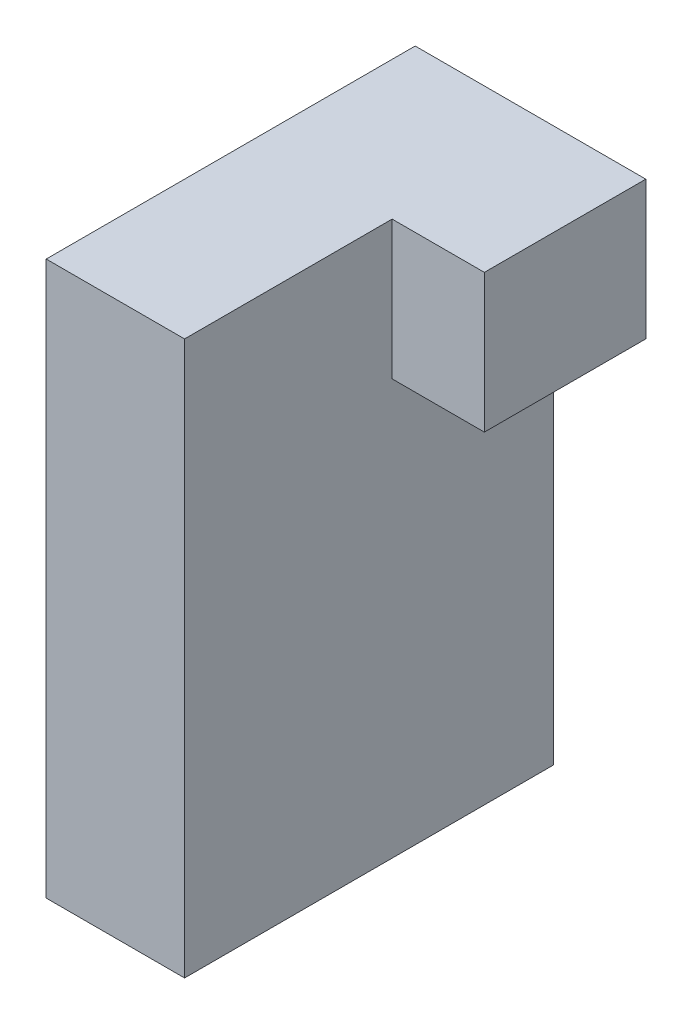
ISO-10303-21;
HEADER;
FILE_DESCRIPTION(('STEP AP214'),'2;1');
FILE_NAME('part.step','',(''),(''),'','','');
FILE_SCHEMA(('AUTOMOTIVE_DESIGN { 1 0 10303 214 1 1 1 1 }'));
ENDSEC;
DATA;
#1=APPLICATION_CONTEXT('core data for automotive mechanical design processes');
#2=APPLICATION_PROTOCOL_DEFINITION('international standard','automotive_design',2000,#1);
#3=PRODUCT_CONTEXT('',#1,'mechanical');
#4=PRODUCT('Part','Part','',(#3));
#5=PRODUCT_RELATED_PRODUCT_CATEGORY('part','',(#4));
#6=PRODUCT_DEFINITION_FORMATION('','',#4);
#7=PRODUCT_DEFINITION_CONTEXT('part definition',#1,'design');
#8=PRODUCT_DEFINITION('design','',#6,#7);
#9=PRODUCT_DEFINITION_SHAPE('','',#8);
#10=(LENGTH_UNIT() NAMED_UNIT(*) SI_UNIT(.MILLI.,.METRE.));
#11=(NAMED_UNIT(*) PLANE_ANGLE_UNIT() SI_UNIT($,.RADIAN.));
#12=(NAMED_UNIT(*) SI_UNIT($,.STERADIAN.) SOLID_ANGLE_UNIT());
#13=UNCERTAINTY_MEASURE_WITH_UNIT(LENGTH_MEASURE(1.E-05),#10,'distance_accuracy_value','');
#14=(GEOMETRIC_REPRESENTATION_CONTEXT(3) GLOBAL_UNCERTAINTY_ASSIGNED_CONTEXT((#13)) GLOBAL_UNIT_ASSIGNED_CONTEXT((#10,
#11,#12)) REPRESENTATION_CONTEXT('',''));
#15=CARTESIAN_POINT('',(0.,0.,0.));
#16=DIRECTION('',(0.,0.,1.));
#17=DIRECTION('',(1.,0.,0.));
#18=AXIS2_PLACEMENT_3D('',#15,#16,#17);
#19=CARTESIAN_POINT('',(9.525,38.1,25.4));
#20=DIRECTION('',(0.,0.,-1.));
#21=DIRECTION('',(0.,1.,0.));
#22=AXIS2_PLACEMENT_3D('',#19,#20,#21);
#23=PLANE('',#22);
#24=DIRECTION('',(0.,-1.,0.));
#25=VECTOR('',#24,1.);
#26=CARTESIAN_POINT('',(-9.525,38.1,25.4));
#27=LINE('',#26,#25);
#28=CARTESIAN_POINT('',(-9.525,38.1,25.4));
#29=VERTEX_POINT('',#28);
#30=CARTESIAN_POINT('',(-9.525,-38.1,25.4));
#31=VERTEX_POINT('',#30);
#32=EDGE_CURVE('E135',#29,#31,#27,.T.);
#33=ORIENTED_EDGE('',*,*,#32,.T.);
#34=DIRECTION('',(-1.,0.,0.));
#35=VECTOR('',#34,1.);
#36=CARTESIAN_POINT('',(9.525,-38.1,25.4));
#37=LINE('',#36,#35);
#38=CARTESIAN_POINT('',(9.525,-38.1,25.4));
#39=VERTEX_POINT('',#38);
#40=EDGE_CURVE('E11',#39,#31,#37,.T.);
#41=ORIENTED_EDGE('',*,*,#40,.F.);
#42=DIRECTION('',(0.,-1.,0.));
#43=VECTOR('',#42,1.);
#44=CARTESIAN_POINT('',(9.525,38.1,25.4));
#45=LINE('',#44,#43);
#46=CARTESIAN_POINT('',(9.525,38.1,25.4));
#47=VERTEX_POINT('',#46);
#48=EDGE_CURVE('E156',#47,#39,#45,.T.);
#49=ORIENTED_EDGE('',*,*,#48,.F.);
#50=DIRECTION('',(-1.,0.,0.));
#51=VECTOR('',#50,1.);
#52=CARTESIAN_POINT('',(9.525,38.1,25.4));
#53=LINE('',#52,#51);
#54=EDGE_CURVE('E103',#47,#29,#53,.T.);
#55=ORIENTED_EDGE('',*,*,#54,.T.);
#56=EDGE_LOOP('',(#33,#41,#49,#55));
#57=FACE_BOUND('',#56,.T.);
#58=ADVANCED_FACE('F33',(#57),#23,.F.);
#59=CARTESIAN_POINT('',(9.525,-38.1,25.4));
#60=DIRECTION('',(0.,1.,0.));
#61=DIRECTION('',(0.,0.,1.));
#62=AXIS2_PLACEMENT_3D('',#59,#60,#61);
#63=PLANE('',#62);
#64=DIRECTION('',(0.,0.,-1.));
#65=VECTOR('',#64,1.);
#66=CARTESIAN_POINT('',(-9.525,-38.1,25.4));
#67=LINE('',#66,#65);
#68=CARTESIAN_POINT('',(-9.525,-38.1,-25.4));
#69=VERTEX_POINT('',#68);
#70=EDGE_CURVE('E138',#31,#69,#67,.T.);
#71=ORIENTED_EDGE('',*,*,#70,.T.);
#72=DIRECTION('',(-1.,0.,0.));
#73=VECTOR('',#72,1.);
#74=CARTESIAN_POINT('',(9.525,-38.1,-25.4));
#75=LINE('',#74,#73);
#76=CARTESIAN_POINT('',(9.525,-38.1,-25.4));
#77=VERTEX_POINT('',#76);
#78=EDGE_CURVE('E41',#77,#69,#75,.T.);
#79=ORIENTED_EDGE('',*,*,#78,.F.);
#80=DIRECTION('',(0.,0.,-1.));
#81=VECTOR('',#80,1.);
#82=CARTESIAN_POINT('',(9.525,-38.1,25.4));
#83=LINE('',#82,#81);
#84=EDGE_CURVE('E169',#39,#77,#83,.T.);
#85=ORIENTED_EDGE('',*,*,#84,.F.);
#86=ORIENTED_EDGE('',*,*,#40,.T.);
#87=EDGE_LOOP('',(#71,#79,#85,#86));
#88=FACE_BOUND('',#87,.T.);
#89=ADVANCED_FACE('F171',(#88),#63,.F.);
#90=CARTESIAN_POINT('',(9.525,38.1,-25.4));
#91=DIRECTION('',(0.,0.,1.));
#92=DIRECTION('',(0.,-1.,0.));
#93=AXIS2_PLACEMENT_3D('',#90,#91,#92);
#94=PLANE('',#93);
#95=DIRECTION('',(0.,1.,0.));
#96=VECTOR('',#95,1.);
#97=CARTESIAN_POINT('',(-9.525,38.1,-25.4));
#98=LINE('',#97,#96);
#99=CARTESIAN_POINT('',(-9.525,38.1,-25.4));
#100=VERTEX_POINT('',#99);
#101=EDGE_CURVE('E100',#69,#100,#98,.T.);
#102=ORIENTED_EDGE('',*,*,#101,.T.);
#103=DIRECTION('',(-1.,0.,0.));
#104=VECTOR('',#103,1.);
#105=CARTESIAN_POINT('',(9.525,38.1,-25.4));
#106=LINE('',#105,#104);
#107=CARTESIAN_POINT('',(22.225,38.1,-25.4));
#108=VERTEX_POINT('',#107);
#109=EDGE_CURVE('E92',#108,#100,#106,.T.);
#110=ORIENTED_EDGE('',*,*,#109,.F.);
#111=DIRECTION('',(0.,1.,0.));
#112=VECTOR('',#111,1.);
#113=CARTESIAN_POINT('',(22.225,38.1,-25.4));
#114=LINE('',#113,#112);
#115=CARTESIAN_POINT('',(22.225,19.05,-25.4));
#116=VERTEX_POINT('',#115);
#117=EDGE_CURVE('E97',#116,#108,#114,.T.);
#118=ORIENTED_EDGE('',*,*,#117,.F.);
#119=DIRECTION('',(-1.,0.,0.));
#120=VECTOR('',#119,1.);
#121=CARTESIAN_POINT('',(22.225,19.05,-25.4));
#122=LINE('',#121,#120);
#123=CARTESIAN_POINT('',(9.525,19.05,-25.4));
#124=VERTEX_POINT('',#123);
#125=EDGE_CURVE('E124',#116,#124,#122,.T.);
#126=ORIENTED_EDGE('',*,*,#125,.T.);
#127=DIRECTION('',(0.,1.,0.));
#128=VECTOR('',#127,1.);
#129=CARTESIAN_POINT('',(9.525,38.1,-25.4));
#130=LINE('',#129,#128);
#131=EDGE_CURVE('E55',#77,#124,#130,.T.);
#132=ORIENTED_EDGE('',*,*,#131,.F.);
#133=ORIENTED_EDGE('',*,*,#78,.T.);
#134=EDGE_LOOP('',(#102,#110,#118,#126,#132,#133));
#135=FACE_BOUND('',#134,.T.);
#136=ADVANCED_FACE('F94',(#135),#94,.F.);
#137=CARTESIAN_POINT('',(9.525,38.1,25.4));
#138=DIRECTION('',(0.,-1.,0.));
#139=DIRECTION('',(0.,0.,-1.));
#140=AXIS2_PLACEMENT_3D('',#137,#138,#139);
#141=PLANE('',#140);
#142=DIRECTION('',(0.,0.,1.));
#143=VECTOR('',#142,1.);
#144=CARTESIAN_POINT('',(-9.525,38.1,25.4));
#145=LINE('',#144,#143);
#146=EDGE_CURVE('E154',#100,#29,#145,.T.);
#147=ORIENTED_EDGE('',*,*,#146,.T.);
#148=ORIENTED_EDGE('',*,*,#54,.F.);
#149=DIRECTION('',(0.,0.,1.));
#150=VECTOR('',#149,1.);
#151=CARTESIAN_POINT('',(9.525,38.1,25.4));
#152=LINE('',#151,#150);
#153=CARTESIAN_POINT('',(9.525,38.1,-3.17499999999999));
#154=VERTEX_POINT('',#153);
#155=EDGE_CURVE('E144',#154,#47,#152,.T.);
#156=ORIENTED_EDGE('',*,*,#155,.F.);
#157=DIRECTION('',(-1.,0.,0.));
#158=VECTOR('',#157,1.);
#159=CARTESIAN_POINT('',(22.225,38.1,-3.17499999999999));
#160=LINE('',#159,#158);
#161=CARTESIAN_POINT('',(22.225,38.1,-3.17499999999999));
#162=VERTEX_POINT('',#161);
#163=EDGE_CURVE('E109',#162,#154,#160,.T.);
#164=ORIENTED_EDGE('',*,*,#163,.F.);
#165=DIRECTION('',(0.,0.,1.));
#166=VECTOR('',#165,1.);
#167=CARTESIAN_POINT('',(22.225,38.1,-25.4));
#168=LINE('',#167,#166);
#169=EDGE_CURVE('E106',#108,#162,#168,.T.);
#170=ORIENTED_EDGE('',*,*,#169,.F.);
#171=ORIENTED_EDGE('',*,*,#109,.T.);
#172=EDGE_LOOP('',(#147,#148,#156,#164,#170,#171));
#173=FACE_BOUND('',#172,.T.);
#174=ADVANCED_FACE('F107',(#173),#141,.F.);
#175=CARTESIAN_POINT('',(9.525,0.,0.));
#176=DIRECTION('',(1.,0.,0.));
#177=DIRECTION('',(0.,0.,-1.));
#178=AXIS2_PLACEMENT_3D('',#175,#176,#177);
#179=PLANE('',#178);
#180=DIRECTION('',(0.,0.,-1.));
#181=VECTOR('',#180,1.);
#182=CARTESIAN_POINT('',(9.525,19.05,-25.4));
#183=LINE('',#182,#181);
#184=CARTESIAN_POINT('',(9.525,19.05,-3.175));
#185=VERTEX_POINT('',#184);
#186=EDGE_CURVE('E118',#185,#124,#183,.T.);
#187=ORIENTED_EDGE('',*,*,#186,.F.);
#188=DIRECTION('',(0.,-1.,0.));
#189=VECTOR('',#188,1.);
#190=CARTESIAN_POINT('',(9.525,38.1,-3.17499999999999));
#191=LINE('',#190,#189);
#192=EDGE_CURVE('E49',#154,#185,#191,.T.);
#193=ORIENTED_EDGE('',*,*,#192,.F.);
#194=ORIENTED_EDGE('',*,*,#155,.T.);
#195=ORIENTED_EDGE('',*,*,#48,.T.);
#196=ORIENTED_EDGE('',*,*,#84,.T.);
#197=ORIENTED_EDGE('',*,*,#131,.T.);
#198=EDGE_LOOP('',(#187,#193,#194,#195,#196,#197));
#199=FACE_BOUND('',#198,.T.);
#200=ADVANCED_FACE('F170',(#199),#179,.T.);
#201=CARTESIAN_POINT('',(-9.525,0.,0.));
#202=DIRECTION('',(1.,0.,0.));
#203=DIRECTION('',(0.,0.,-1.));
#204=AXIS2_PLACEMENT_3D('',#201,#202,#203);
#205=PLANE('',#204);
#206=ORIENTED_EDGE('',*,*,#32,.F.);
#207=ORIENTED_EDGE('',*,*,#146,.F.);
#208=ORIENTED_EDGE('',*,*,#101,.F.);
#209=ORIENTED_EDGE('',*,*,#70,.F.);
#210=EDGE_LOOP('',(#206,#207,#208,#209));
#211=FACE_BOUND('',#210,.T.);
#212=ADVANCED_FACE('F163',(#211),#205,.F.);
#213=CARTESIAN_POINT('',(22.225,38.1,-3.17499999999999));
#214=DIRECTION('',(0.,0.,-1.));
#215=DIRECTION('',(0.,1.,0.));
#216=AXIS2_PLACEMENT_3D('',#213,#214,#215);
#217=PLANE('',#216);
#218=ORIENTED_EDGE('',*,*,#192,.T.);
#219=DIRECTION('',(-1.,0.,0.));
#220=VECTOR('',#219,1.);
#221=CARTESIAN_POINT('',(22.225,19.05,-3.175));
#222=LINE('',#221,#220);
#223=CARTESIAN_POINT('',(22.225,19.05,-3.175));
#224=VERTEX_POINT('',#223);
#225=EDGE_CURVE('E127',#224,#185,#222,.T.);
#226=ORIENTED_EDGE('',*,*,#225,.F.);
#227=DIRECTION('',(0.,-1.,0.));
#228=VECTOR('',#227,1.);
#229=CARTESIAN_POINT('',(22.225,38.1,-3.17499999999999));
#230=LINE('',#229,#228);
#231=EDGE_CURVE('E112',#162,#224,#230,.T.);
#232=ORIENTED_EDGE('',*,*,#231,.F.);
#233=ORIENTED_EDGE('',*,*,#163,.T.);
#234=EDGE_LOOP('',(#218,#226,#232,#233));
#235=FACE_BOUND('',#234,.T.);
#236=ADVANCED_FACE('F183',(#235),#217,.F.);
#237=CARTESIAN_POINT('',(22.225,19.05,-25.4));
#238=DIRECTION('',(0.,1.,0.));
#239=DIRECTION('',(0.,0.,1.));
#240=AXIS2_PLACEMENT_3D('',#237,#238,#239);
#241=PLANE('',#240);
#242=ORIENTED_EDGE('',*,*,#186,.T.);
#243=ORIENTED_EDGE('',*,*,#125,.F.);
#244=DIRECTION('',(0.,0.,-1.));
#245=VECTOR('',#244,1.);
#246=CARTESIAN_POINT('',(22.225,19.05,-25.4));
#247=LINE('',#246,#245);
#248=EDGE_CURVE('E116',#224,#116,#247,.T.);
#249=ORIENTED_EDGE('',*,*,#248,.F.);
#250=ORIENTED_EDGE('',*,*,#225,.T.);
#251=EDGE_LOOP('',(#242,#243,#249,#250));
#252=FACE_BOUND('',#251,.T.);
#253=ADVANCED_FACE('F188',(#252),#241,.F.);
#254=CARTESIAN_POINT('',(22.225,0.,0.));
#255=DIRECTION('',(-1.,0.,0.));
#256=DIRECTION('',(0.,0.,1.));
#257=AXIS2_PLACEMENT_3D('',#254,#255,#256);
#258=PLANE('',#257);
#259=ORIENTED_EDGE('',*,*,#117,.T.);
#260=ORIENTED_EDGE('',*,*,#169,.T.);
#261=ORIENTED_EDGE('',*,*,#231,.T.);
#262=ORIENTED_EDGE('',*,*,#248,.T.);
#263=EDGE_LOOP('',(#259,#260,#261,#262));
#264=FACE_BOUND('',#263,.T.);
#265=ADVANCED_FACE('F114',(#264),#258,.F.);
#266=CLOSED_SHELL('',(#58,#89,#136,#174,#200,#212,#236,#253,#265));
#267=MANIFOLD_SOLID_BREP('B2',#266);
#268=ADVANCED_BREP_SHAPE_REPRESENTATION('',(#18,#267),#14);
#269=SHAPE_DEFINITION_REPRESENTATION(#9,#268);
ENDSEC;
END-ISO-10303-21;
